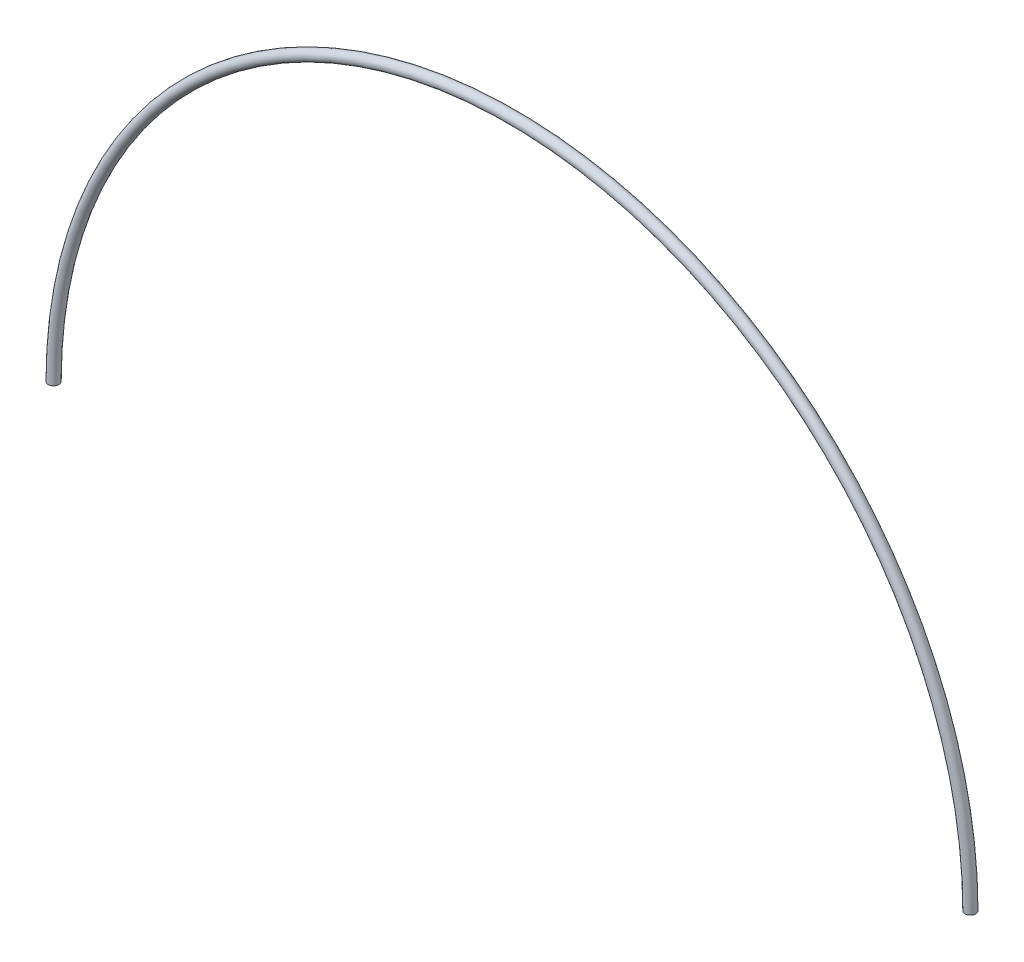
ISO-10303-21;
HEADER;
FILE_DESCRIPTION(('STEP AP214'),'2;1');
FILE_NAME('part.step','',(''),(''),'','','');
FILE_SCHEMA(('AUTOMOTIVE_DESIGN { 1 0 10303 214 1 1 1 1 }'));
ENDSEC;
DATA;
#1=APPLICATION_CONTEXT('core data for automotive mechanical design processes');
#2=APPLICATION_PROTOCOL_DEFINITION('international standard','automotive_design',2000,#1);
#3=PRODUCT_CONTEXT('',#1,'mechanical');
#4=PRODUCT('Part','Part','',(#3));
#5=PRODUCT_RELATED_PRODUCT_CATEGORY('part','',(#4));
#6=PRODUCT_DEFINITION_FORMATION('','',#4);
#7=PRODUCT_DEFINITION_CONTEXT('part definition',#1,'design');
#8=PRODUCT_DEFINITION('design','',#6,#7);
#9=PRODUCT_DEFINITION_SHAPE('','',#8);
#10=(LENGTH_UNIT() NAMED_UNIT(*) SI_UNIT(.MILLI.,.METRE.));
#11=(NAMED_UNIT(*) PLANE_ANGLE_UNIT() SI_UNIT($,.RADIAN.));
#12=(NAMED_UNIT(*) SI_UNIT($,.STERADIAN.) SOLID_ANGLE_UNIT());
#13=UNCERTAINTY_MEASURE_WITH_UNIT(LENGTH_MEASURE(1.E-05),#10,'distance_accuracy_value','');
#14=(GEOMETRIC_REPRESENTATION_CONTEXT(3) GLOBAL_UNCERTAINTY_ASSIGNED_CONTEXT((#13)) GLOBAL_UNIT_ASSIGNED_CONTEXT((#10,
#11,#12)) REPRESENTATION_CONTEXT('',''));
#15=CARTESIAN_POINT('',(0.,0.,0.));
#16=DIRECTION('',(0.,0.,1.));
#17=DIRECTION('',(1.,0.,0.));
#18=AXIS2_PLACEMENT_3D('',#15,#16,#17);
#19=CARTESIAN_POINT('',(0.,0.,0.));
#20=DIRECTION('',(0.,0.,-1.));
#21=DIRECTION('',(-1.,0.,0.));
#22=AXIS2_PLACEMENT_3D('',#19,#20,#21);
#23=TOROIDAL_SURFACE('',#22,406.4,4.76250000000001);
#24=CARTESIAN_POINT('',(-406.4,0.,0.));
#25=DIRECTION('',(0.,1.,0.));
#26=DIRECTION('',(-1.,0.,0.));
#27=AXIS2_PLACEMENT_3D('',#24,#25,#26);
#28=CIRCLE('',#27,4.76250000000001);
#29=CARTESIAN_POINT('',(-411.1625,0.,0.));
#30=VERTEX_POINT('',#29);
#31=EDGE_CURVE('E10',#30,#30,#28,.T.);
#32=CARTESIAN_POINT('',(406.4,0.,0.));
#33=DIRECTION('',(0.,-1.,0.));
#34=DIRECTION('',(1.,0.,0.));
#35=AXIS2_PLACEMENT_3D('',#32,#33,#34);
#36=CIRCLE('',#35,4.76250000000001);
#37=CARTESIAN_POINT('',(411.1625,0.,0.));
#38=VERTEX_POINT('',#37);
#39=EDGE_CURVE('E39',#38,#38,#36,.T.);
#40=CARTESIAN_POINT('',(0.,0.,0.));
#41=DIRECTION('',(0.,0.,-1.));
#42=DIRECTION('',(-1.,0.,0.));
#43=AXIS2_PLACEMENT_3D('',#40,#41,#42);
#44=CIRCLE('',#43,411.1625);
#45=EDGE_CURVE('',#30,#38,#44,.T.);
#46=ORIENTED_EDGE('',*,*,#31,.T.);
#47=ORIENTED_EDGE('',*,*,#39,.F.);
#48=ORIENTED_EDGE('',*,*,#45,.T.);
#49=ORIENTED_EDGE('',*,*,#45,.F.);
#50=EDGE_LOOP('',(#46,#48,#47,#49));
#51=FACE_BOUND('',#50,.T.);
#52=ADVANCED_FACE('F33',(#51),#23,.T.);
#53=CARTESIAN_POINT('',(-406.4,0.,0.));
#54=DIRECTION('',(0.,1.,0.));
#55=DIRECTION('',(-1.,0.,0.));
#56=AXIS2_PLACEMENT_3D('',#53,#54,#55);
#57=PLANE('',#56);
#58=ORIENTED_EDGE('',*,*,#31,.F.);
#59=EDGE_LOOP('',(#58));
#60=FACE_BOUND('',#59,.T.);
#61=ADVANCED_FACE('F48',(#60),#57,.F.);
#62=CARTESIAN_POINT('',(406.4,0.,0.));
#63=DIRECTION('',(0.,-1.,0.));
#64=DIRECTION('',(1.,0.,0.));
#65=AXIS2_PLACEMENT_3D('',#62,#63,#64);
#66=PLANE('',#65);
#67=ORIENTED_EDGE('',*,*,#39,.T.);
#68=EDGE_LOOP('',(#67));
#69=FACE_BOUND('',#68,.T.);
#70=ADVANCED_FACE('F45',(#69),#66,.T.);
#71=CLOSED_SHELL('',(#52,#61,#70));
#72=MANIFOLD_SOLID_BREP('B2',#71);
#73=ADVANCED_BREP_SHAPE_REPRESENTATION('',(#18,#72),#14);
#74=SHAPE_DEFINITION_REPRESENTATION(#9,#73);
ENDSEC;
END-ISO-10303-21;
